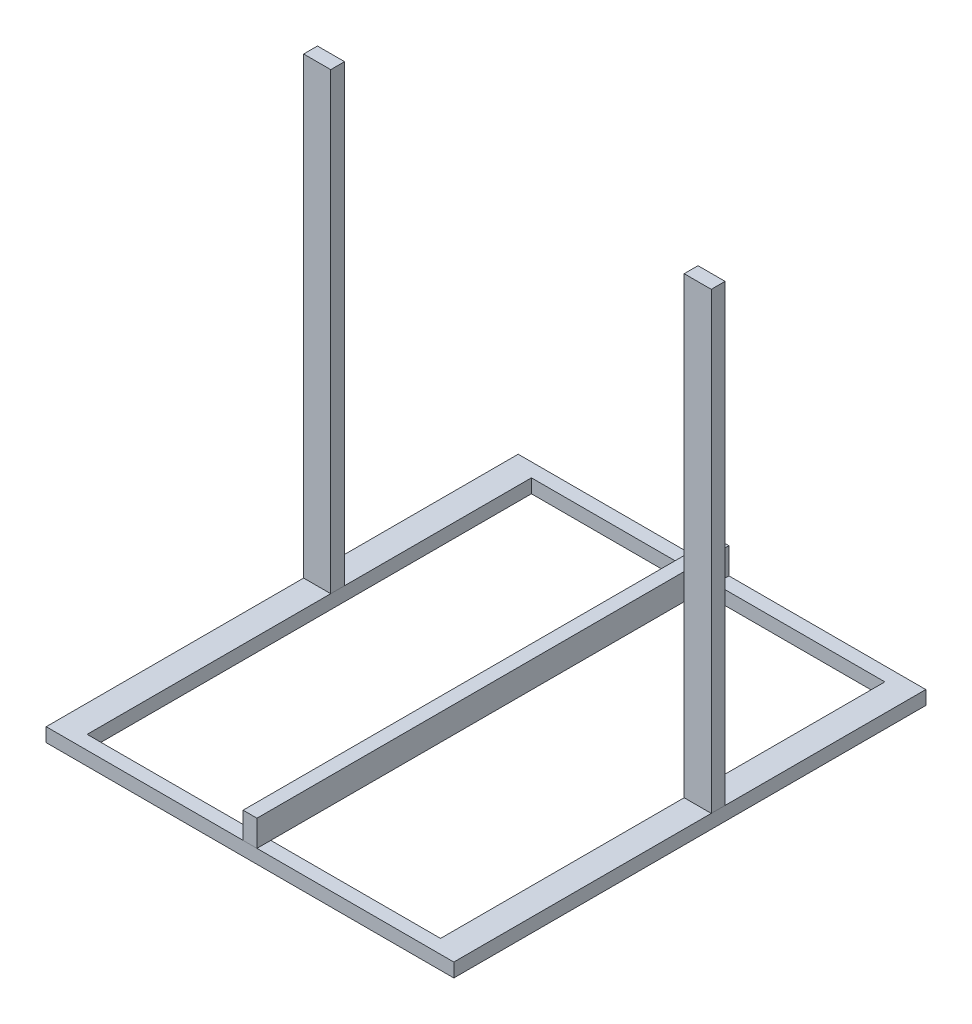
ISO-10303-21;
HEADER;
FILE_DESCRIPTION(('STEP AP214'),'2;1');
FILE_NAME('part.step','',(''),(''),'','','');
FILE_SCHEMA(('AUTOMOTIVE_DESIGN { 1 0 10303 214 1 1 1 1 }'));
ENDSEC;
DATA;
#1=APPLICATION_CONTEXT('core data for automotive mechanical design processes');
#2=APPLICATION_PROTOCOL_DEFINITION('international standard','automotive_design',2000,#1);
#3=PRODUCT_CONTEXT('',#1,'mechanical');
#4=PRODUCT('Part','Part','',(#3));
#5=PRODUCT_RELATED_PRODUCT_CATEGORY('part','',(#4));
#6=PRODUCT_DEFINITION_FORMATION('','',#4);
#7=PRODUCT_DEFINITION_CONTEXT('part definition',#1,'design');
#8=PRODUCT_DEFINITION('design','',#6,#7);
#9=PRODUCT_DEFINITION_SHAPE('','',#8);
#10=(LENGTH_UNIT() NAMED_UNIT(*) SI_UNIT(.MILLI.,.METRE.));
#11=(NAMED_UNIT(*) PLANE_ANGLE_UNIT() SI_UNIT($,.RADIAN.));
#12=(NAMED_UNIT(*) SI_UNIT($,.STERADIAN.) SOLID_ANGLE_UNIT());
#13=UNCERTAINTY_MEASURE_WITH_UNIT(LENGTH_MEASURE(1.E-05),#10,'distance_accuracy_value','');
#14=(GEOMETRIC_REPRESENTATION_CONTEXT(3) GLOBAL_UNCERTAINTY_ASSIGNED_CONTEXT((#13)) GLOBAL_UNIT_ASSIGNED_CONTEXT((#10,
#11,#12)) REPRESENTATION_CONTEXT('',''));
#15=CARTESIAN_POINT('',(0.,0.,0.));
#16=DIRECTION('',(0.,0.,1.));
#17=DIRECTION('',(1.,0.,0.));
#18=AXIS2_PLACEMENT_3D('',#15,#16,#17);
#19=CARTESIAN_POINT('',(-10.27,20.47,328.78));
#20=DIRECTION('',(0.,1.,0.));
#21=DIRECTION('',(0.,0.,1.));
#22=AXIS2_PLACEMENT_3D('',#19,#20,#21);
#23=PLANE('',#22);
#24=DIRECTION('',(-1.,0.,0.));
#25=VECTOR('',#24,1.);
#26=CARTESIAN_POINT('',(261.525,20.47,-328.78));
#27=LINE('',#26,#25);
#28=CARTESIAN_POINT('',(261.525,20.47,-328.78));
#29=VERTEX_POINT('',#28);
#30=CARTESIAN_POINT('',(-261.525,20.47,-328.78));
#31=VERTEX_POINT('',#30);
#32=EDGE_CURVE('E120',#29,#31,#27,.T.);
#33=ORIENTED_EDGE('',*,*,#32,.F.);
#34=DIRECTION('',(0.,0.,-1.));
#35=VECTOR('',#34,1.);
#36=CARTESIAN_POINT('',(261.525,20.47,-328.78));
#37=LINE('',#36,#35);
#38=CARTESIAN_POINT('',(261.525,20.47,328.78));
#39=VERTEX_POINT('',#38);
#40=EDGE_CURVE('E122',#39,#29,#37,.T.);
#41=ORIENTED_EDGE('',*,*,#40,.F.);
#42=DIRECTION('',(1.,0.,0.));
#43=VECTOR('',#42,1.);
#44=CARTESIAN_POINT('',(261.525,20.47,328.78));
#45=LINE('',#44,#43);
#46=CARTESIAN_POINT('',(-261.525,20.47,328.78));
#47=VERTEX_POINT('',#46);
#48=EDGE_CURVE('E12',#47,#39,#45,.T.);
#49=ORIENTED_EDGE('',*,*,#48,.F.);
#50=DIRECTION('',(0.,0.,1.));
#51=VECTOR('',#50,1.);
#52=CARTESIAN_POINT('',(-261.525,20.47,-328.78));
#53=LINE('',#52,#51);
#54=EDGE_CURVE('E124',#31,#47,#53,.T.);
#55=ORIENTED_EDGE('',*,*,#54,.F.);
#56=EDGE_LOOP('',(#33,#41,#49,#55));
#57=FACE_BOUND('',#56,.T.);
#58=DIRECTION('',(-1.,0.,0.));
#59=VECTOR('',#58,1.);
#60=CARTESIAN_POINT('',(-301.625,20.47,-349.25));
#61=LINE('',#60,#59);
#62=CARTESIAN_POINT('',(301.625,20.47,-349.25));
#63=VERTEX_POINT('',#62);
#64=CARTESIAN_POINT('',(-301.625,20.47,-349.25));
#65=VERTEX_POINT('',#64);
#66=EDGE_CURVE('E172',#63,#65,#61,.T.);
#67=ORIENTED_EDGE('',*,*,#66,.T.);
#68=DIRECTION('',(0.,0.,1.));
#69=VECTOR('',#68,1.);
#70=CARTESIAN_POINT('',(-301.625,20.47,349.25));
#71=LINE('',#70,#69);
#72=CARTESIAN_POINT('',(-301.625,20.47,349.25));
#73=VERTEX_POINT('',#72);
#74=EDGE_CURVE('E176',#65,#73,#71,.T.);
#75=ORIENTED_EDGE('',*,*,#74,.T.);
#76=DIRECTION('',(1.,0.,0.));
#77=VECTOR('',#76,1.);
#78=CARTESIAN_POINT('',(-301.625,20.47,349.25));
#79=LINE('',#78,#77);
#80=CARTESIAN_POINT('',(301.625,20.47,349.25));
#81=VERTEX_POINT('',#80);
#82=EDGE_CURVE('E180',#73,#81,#79,.T.);
#83=ORIENTED_EDGE('',*,*,#82,.T.);
#84=DIRECTION('',(0.,0.,-1.));
#85=VECTOR('',#84,1.);
#86=CARTESIAN_POINT('',(301.625,20.47,349.25));
#87=LINE('',#86,#85);
#88=EDGE_CURVE('E167',#81,#63,#87,.T.);
#89=ORIENTED_EDGE('',*,*,#88,.T.);
#90=EDGE_LOOP('',(#67,#75,#83,#89));
#91=FACE_BOUND('',#90,.T.);
#92=ADVANCED_FACE('F51',(#57,#91),#23,.T.);
#93=CARTESIAN_POINT('',(-301.625,20.47,-349.25));
#94=DIRECTION('',(0.,0.,1.));
#95=DIRECTION('',(1.,0.,0.));
#96=AXIS2_PLACEMENT_3D('',#93,#94,#95);
#97=PLANE('',#96);
#98=ORIENTED_EDGE('',*,*,#66,.F.);
#99=DIRECTION('',(0.,-1.,0.));
#100=VECTOR('',#99,1.);
#101=CARTESIAN_POINT('',(301.625,20.47,-349.25));
#102=LINE('',#101,#100);
#103=CARTESIAN_POINT('',(301.625,0.,-349.25));
#104=VERTEX_POINT('',#103);
#105=EDGE_CURVE('E203',#63,#104,#102,.T.);
#106=ORIENTED_EDGE('',*,*,#105,.T.);
#107=DIRECTION('',(-1.,0.,0.));
#108=VECTOR('',#107,1.);
#109=CARTESIAN_POINT('',(-301.625,0.,-349.25));
#110=LINE('',#109,#108);
#111=CARTESIAN_POINT('',(-301.625,0.,-349.25));
#112=VERTEX_POINT('',#111);
#113=EDGE_CURVE('E164',#104,#112,#110,.T.);
#114=ORIENTED_EDGE('',*,*,#113,.T.);
#115=DIRECTION('',(0.,-1.,0.));
#116=VECTOR('',#115,1.);
#117=CARTESIAN_POINT('',(-301.625,20.47,-349.25));
#118=LINE('',#117,#116);
#119=EDGE_CURVE('E199',#65,#112,#118,.T.);
#120=ORIENTED_EDGE('',*,*,#119,.F.);
#121=EDGE_LOOP('',(#98,#106,#114,#120));
#122=FACE_BOUND('',#121,.T.);
#123=ADVANCED_FACE('F208',(#122),#97,.F.);
#124=CARTESIAN_POINT('',(301.625,20.47,349.25));
#125=DIRECTION('',(-1.,0.,0.));
#126=DIRECTION('',(0.,0.,1.));
#127=AXIS2_PLACEMENT_3D('',#124,#125,#126);
#128=PLANE('',#127);
#129=ORIENTED_EDGE('',*,*,#88,.F.);
#130=DIRECTION('',(0.,-1.,0.));
#131=VECTOR('',#130,1.);
#132=CARTESIAN_POINT('',(301.625,20.47,349.25));
#133=LINE('',#132,#131);
#134=CARTESIAN_POINT('',(301.625,0.,349.25));
#135=VERTEX_POINT('',#134);
#136=EDGE_CURVE('E183',#81,#135,#133,.T.);
#137=ORIENTED_EDGE('',*,*,#136,.T.);
#138=DIRECTION('',(0.,0.,-1.));
#139=VECTOR('',#138,1.);
#140=CARTESIAN_POINT('',(301.625,0.,349.25));
#141=LINE('',#140,#139);
#142=EDGE_CURVE('E161',#135,#104,#141,.T.);
#143=ORIENTED_EDGE('',*,*,#142,.T.);
#144=ORIENTED_EDGE('',*,*,#105,.F.);
#145=EDGE_LOOP('',(#129,#137,#143,#144));
#146=FACE_BOUND('',#145,.T.);
#147=ADVANCED_FACE('F212',(#146),#128,.F.);
#148=CARTESIAN_POINT('',(-261.525,20.47,-328.78));
#149=DIRECTION('',(1.,0.,0.));
#150=DIRECTION('',(0.,0.,-1.));
#151=AXIS2_PLACEMENT_3D('',#148,#149,#150);
#152=PLANE('',#151);
#153=DIRECTION('',(0.,-1.,0.));
#154=VECTOR('',#153,1.);
#155=CARTESIAN_POINT('',(-261.525,20.47,-328.78));
#156=LINE('',#155,#154);
#157=CARTESIAN_POINT('',(-261.525,0.,-328.78));
#158=VERTEX_POINT('',#157);
#159=EDGE_CURVE('E129',#31,#158,#156,.T.);
#160=ORIENTED_EDGE('',*,*,#159,.F.);
#161=ORIENTED_EDGE('',*,*,#54,.T.);
#162=DIRECTION('',(0.,-1.,0.));
#163=VECTOR('',#162,1.);
#164=CARTESIAN_POINT('',(-261.525,20.47,328.78));
#165=LINE('',#164,#163);
#166=CARTESIAN_POINT('',(-261.525,0.,328.78));
#167=VERTEX_POINT('',#166);
#168=EDGE_CURVE('E142',#47,#167,#165,.T.);
#169=ORIENTED_EDGE('',*,*,#168,.T.);
#170=DIRECTION('',(0.,0.,1.));
#171=VECTOR('',#170,1.);
#172=CARTESIAN_POINT('',(-261.525,0.,-328.78));
#173=LINE('',#172,#171);
#174=EDGE_CURVE('E61',#158,#167,#173,.T.);
#175=ORIENTED_EDGE('',*,*,#174,.F.);
#176=EDGE_LOOP('',(#160,#161,#169,#175));
#177=FACE_BOUND('',#176,.T.);
#178=ADVANCED_FACE('F158',(#177),#152,.T.);
#179=CARTESIAN_POINT('',(261.525,20.47,-328.78));
#180=DIRECTION('',(-1.,0.,0.));
#181=DIRECTION('',(0.,0.,1.));
#182=AXIS2_PLACEMENT_3D('',#179,#180,#181);
#183=PLANE('',#182);
#184=DIRECTION('',(0.,-1.,0.));
#185=VECTOR('',#184,1.);
#186=CARTESIAN_POINT('',(261.525,20.47,328.78));
#187=LINE('',#186,#185);
#188=CARTESIAN_POINT('',(261.525,0.,328.78));
#189=VERTEX_POINT('',#188);
#190=EDGE_CURVE('E130',#39,#189,#187,.T.);
#191=ORIENTED_EDGE('',*,*,#190,.F.);
#192=ORIENTED_EDGE('',*,*,#40,.T.);
#193=DIRECTION('',(0.,-1.,0.));
#194=VECTOR('',#193,1.);
#195=CARTESIAN_POINT('',(261.525,20.47,-328.78));
#196=LINE('',#195,#194);
#197=CARTESIAN_POINT('',(261.525,0.,-328.78));
#198=VERTEX_POINT('',#197);
#199=EDGE_CURVE('E88',#29,#198,#196,.T.);
#200=ORIENTED_EDGE('',*,*,#199,.T.);
#201=DIRECTION('',(0.,0.,-1.));
#202=VECTOR('',#201,1.);
#203=CARTESIAN_POINT('',(261.525,0.,-328.78));
#204=LINE('',#203,#202);
#205=EDGE_CURVE('E148',#189,#198,#204,.T.);
#206=ORIENTED_EDGE('',*,*,#205,.F.);
#207=EDGE_LOOP('',(#191,#192,#200,#206));
#208=FACE_BOUND('',#207,.T.);
#209=ADVANCED_FACE('F53',(#208),#183,.T.);
#210=CARTESIAN_POINT('',(0.,0.,0.));
#211=DIRECTION('',(0.,-1.,0.));
#212=DIRECTION('',(0.,0.,-1.));
#213=AXIS2_PLACEMENT_3D('',#210,#211,#212);
#214=PLANE('',#213);
#215=ORIENTED_EDGE('',*,*,#142,.F.);
#216=DIRECTION('',(1.,0.,0.));
#217=VECTOR('',#216,1.);
#218=CARTESIAN_POINT('',(-301.625,0.,349.25));
#219=LINE('',#218,#217);
#220=CARTESIAN_POINT('',(-301.625,0.,349.25));
#221=VERTEX_POINT('',#220);
#222=EDGE_CURVE('E171',#221,#135,#219,.T.);
#223=ORIENTED_EDGE('',*,*,#222,.F.);
#224=DIRECTION('',(0.,0.,1.));
#225=VECTOR('',#224,1.);
#226=CARTESIAN_POINT('',(-301.625,0.,349.25));
#227=LINE('',#226,#225);
#228=EDGE_CURVE('E187',#112,#221,#227,.T.);
#229=ORIENTED_EDGE('',*,*,#228,.F.);
#230=ORIENTED_EDGE('',*,*,#113,.F.);
#231=EDGE_LOOP('',(#215,#223,#229,#230));
#232=FACE_BOUND('',#231,.T.);
#233=DIRECTION('',(-1.,0.,0.));
#234=VECTOR('',#233,1.);
#235=CARTESIAN_POINT('',(261.525,0.,-328.78));
#236=LINE('',#235,#234);
#237=EDGE_CURVE('E135',#198,#158,#236,.T.);
#238=ORIENTED_EDGE('',*,*,#237,.T.);
#239=ORIENTED_EDGE('',*,*,#174,.T.);
#240=DIRECTION('',(1.,0.,0.));
#241=VECTOR('',#240,1.);
#242=CARTESIAN_POINT('',(261.525,0.,328.78));
#243=LINE('',#242,#241);
#244=EDGE_CURVE('E69',#167,#189,#243,.T.);
#245=ORIENTED_EDGE('',*,*,#244,.T.);
#246=ORIENTED_EDGE('',*,*,#205,.T.);
#247=EDGE_LOOP('',(#238,#239,#245,#246));
#248=FACE_BOUND('',#247,.T.);
#249=ADVANCED_FACE('F216',(#232,#248),#214,.T.);
#250=CARTESIAN_POINT('',(261.525,20.47,-328.78));
#251=DIRECTION('',(0.,0.,1.));
#252=DIRECTION('',(1.,0.,0.));
#253=AXIS2_PLACEMENT_3D('',#250,#251,#252);
#254=PLANE('',#253);
#255=ORIENTED_EDGE('',*,*,#237,.F.);
#256=ORIENTED_EDGE('',*,*,#199,.F.);
#257=ORIENTED_EDGE('',*,*,#32,.T.);
#258=ORIENTED_EDGE('',*,*,#159,.T.);
#259=EDGE_LOOP('',(#255,#256,#257,#258));
#260=FACE_BOUND('',#259,.T.);
#261=ADVANCED_FACE('F133',(#260),#254,.T.);
#262=CARTESIAN_POINT('',(261.525,20.47,328.78));
#263=DIRECTION('',(0.,0.,-1.));
#264=DIRECTION('',(-1.,0.,0.));
#265=AXIS2_PLACEMENT_3D('',#262,#263,#264);
#266=PLANE('',#265);
#267=ORIENTED_EDGE('',*,*,#244,.F.);
#268=ORIENTED_EDGE('',*,*,#168,.F.);
#269=ORIENTED_EDGE('',*,*,#48,.T.);
#270=ORIENTED_EDGE('',*,*,#190,.T.);
#271=EDGE_LOOP('',(#267,#268,#269,#270));
#272=FACE_BOUND('',#271,.T.);
#273=ADVANCED_FACE('F159',(#272),#266,.T.);
#274=CARTESIAN_POINT('',(-301.625,20.47,349.25));
#275=DIRECTION('',(1.,0.,0.));
#276=DIRECTION('',(0.,0.,-1.));
#277=AXIS2_PLACEMENT_3D('',#274,#275,#276);
#278=PLANE('',#277);
#279=ORIENTED_EDGE('',*,*,#74,.F.);
#280=ORIENTED_EDGE('',*,*,#119,.T.);
#281=ORIENTED_EDGE('',*,*,#228,.T.);
#282=DIRECTION('',(0.,-1.,0.));
#283=VECTOR('',#282,1.);
#284=CARTESIAN_POINT('',(-301.625,20.47,349.25));
#285=LINE('',#284,#283);
#286=EDGE_CURVE('E195',#73,#221,#285,.T.);
#287=ORIENTED_EDGE('',*,*,#286,.F.);
#288=EDGE_LOOP('',(#279,#280,#281,#287));
#289=FACE_BOUND('',#288,.T.);
#290=ADVANCED_FACE('F221',(#289),#278,.F.);
#291=CARTESIAN_POINT('',(-301.625,20.47,349.25));
#292=DIRECTION('',(0.,0.,-1.));
#293=DIRECTION('',(-1.,0.,0.));
#294=AXIS2_PLACEMENT_3D('',#291,#292,#293);
#295=PLANE('',#294);
#296=ORIENTED_EDGE('',*,*,#82,.F.);
#297=ORIENTED_EDGE('',*,*,#286,.T.);
#298=ORIENTED_EDGE('',*,*,#222,.T.);
#299=ORIENTED_EDGE('',*,*,#136,.F.);
#300=EDGE_LOOP('',(#296,#297,#298,#299));
#301=FACE_BOUND('',#300,.T.);
#302=ADVANCED_FACE('F223',(#301),#295,.F.);
#303=CLOSED_SHELL('',(#92,#123,#147,#178,#209,#249,#261,#273,#290,#302));
#304=MANIFOLD_SOLID_BREP('B2',#303);
#305=CARTESIAN_POINT('',(-10.27,20.47,328.78));
#306=DIRECTION('',(0.,1.,0.));
#307=DIRECTION('',(0.,0.,1.));
#308=AXIS2_PLACEMENT_3D('',#305,#306,#307);
#309=PLANE('',#308);
#310=DIRECTION('',(1.,0.,0.));
#311=VECTOR('',#310,1.);
#312=CARTESIAN_POINT('',(301.625,20.47,-31.7500000000001));
#313=LINE('',#312,#311);
#314=CARTESIAN_POINT('',(261.525,20.47,-31.7500000000001));
#315=VERTEX_POINT('',#314);
#316=CARTESIAN_POINT('',(301.625,20.47,-31.7500000000001));
#317=VERTEX_POINT('',#316);
#318=EDGE_CURVE('E49',#315,#317,#313,.T.);
#319=ORIENTED_EDGE('',*,*,#318,.F.);
#320=DIRECTION('',(0.,0.,-1.));
#321=VECTOR('',#320,1.);
#322=CARTESIAN_POINT('',(261.525,20.47,-328.78));
#323=LINE('',#322,#321);
#324=CARTESIAN_POINT('',(261.525,20.47,-52.2200000000001));
#325=VERTEX_POINT('',#324);
#326=EDGE_CURVE('E347',#315,#325,#323,.T.);
#327=ORIENTED_EDGE('',*,*,#326,.T.);
#328=DIRECTION('',(-1.,0.,0.));
#329=VECTOR('',#328,1.);
#330=CARTESIAN_POINT('',(301.625,20.47,-52.22));
#331=LINE('',#330,#329);
#332=CARTESIAN_POINT('',(301.625,20.47,-52.22));
#333=VERTEX_POINT('',#332);
#334=EDGE_CURVE('E353',#333,#325,#331,.T.);
#335=ORIENTED_EDGE('',*,*,#334,.F.);
#336=DIRECTION('',(0.,0.,-1.));
#337=VECTOR('',#336,1.);
#338=CARTESIAN_POINT('',(301.625,20.47,349.25));
#339=LINE('',#338,#337);
#340=EDGE_CURVE('E387',#317,#333,#339,.T.);
#341=ORIENTED_EDGE('',*,*,#340,.F.);
#342=EDGE_LOOP('',(#319,#327,#335,#341));
#343=FACE_BOUND('',#342,.T.);
#344=ADVANCED_FACE('F344',(#343),#309,.F.);
#345=CARTESIAN_POINT('',(301.625,20.47,349.25));
#346=DIRECTION('',(-1.,0.,0.));
#347=DIRECTION('',(0.,0.,1.));
#348=AXIS2_PLACEMENT_3D('',#345,#346,#347);
#349=PLANE('',#348);
#350=DIRECTION('',(0.,-1.,0.));
#351=VECTOR('',#350,1.);
#352=CARTESIAN_POINT('',(301.625,692.15,-31.7500000000001));
#353=LINE('',#352,#351);
#354=CARTESIAN_POINT('',(301.625,692.15,-31.7500000000001));
#355=VERTEX_POINT('',#354);
#356=EDGE_CURVE('E407',#355,#317,#353,.T.);
#357=ORIENTED_EDGE('',*,*,#356,.T.);
#358=ORIENTED_EDGE('',*,*,#340,.T.);
#359=DIRECTION('',(0.,-1.,0.));
#360=VECTOR('',#359,1.);
#361=CARTESIAN_POINT('',(301.625,692.15,-52.22));
#362=LINE('',#361,#360);
#363=CARTESIAN_POINT('',(301.625,692.15,-52.22));
#364=VERTEX_POINT('',#363);
#365=EDGE_CURVE('E398',#364,#333,#362,.T.);
#366=ORIENTED_EDGE('',*,*,#365,.F.);
#367=DIRECTION('',(0.,0.,-1.));
#368=VECTOR('',#367,1.);
#369=CARTESIAN_POINT('',(301.625,692.15,-52.22));
#370=LINE('',#369,#368);
#371=EDGE_CURVE('E405',#355,#364,#370,.T.);
#372=ORIENTED_EDGE('',*,*,#371,.F.);
#373=EDGE_LOOP('',(#357,#358,#366,#372));
#374=FACE_BOUND('',#373,.T.);
#375=ADVANCED_FACE('F417',(#374),#349,.F.);
#376=CARTESIAN_POINT('',(0.,692.15,0.));
#377=DIRECTION('',(0.,-1.,0.));
#378=DIRECTION('',(0.,0.,-1.));
#379=AXIS2_PLACEMENT_3D('',#376,#377,#378);
#380=PLANE('',#379);
#381=DIRECTION('',(0.,0.,1.));
#382=VECTOR('',#381,1.);
#383=CARTESIAN_POINT('',(261.525,692.15,-52.2200000000001));
#384=LINE('',#383,#382);
#385=CARTESIAN_POINT('',(261.525,692.15,-52.2200000000001));
#386=VERTEX_POINT('',#385);
#387=CARTESIAN_POINT('',(261.525,692.15,-31.7500000000001));
#388=VERTEX_POINT('',#387);
#389=EDGE_CURVE('E400',#386,#388,#384,.T.);
#390=ORIENTED_EDGE('',*,*,#389,.T.);
#391=DIRECTION('',(1.,0.,0.));
#392=VECTOR('',#391,1.);
#393=CARTESIAN_POINT('',(301.625,692.15,-31.7500000000001));
#394=LINE('',#393,#392);
#395=EDGE_CURVE('E379',#388,#355,#394,.T.);
#396=ORIENTED_EDGE('',*,*,#395,.T.);
#397=ORIENTED_EDGE('',*,*,#371,.T.);
#398=DIRECTION('',(-1.,0.,0.));
#399=VECTOR('',#398,1.);
#400=CARTESIAN_POINT('',(301.625,692.15,-52.22));
#401=LINE('',#400,#399);
#402=EDGE_CURVE('E403',#364,#386,#401,.T.);
#403=ORIENTED_EDGE('',*,*,#402,.T.);
#404=EDGE_LOOP('',(#390,#396,#397,#403));
#405=FACE_BOUND('',#404,.T.);
#406=ADVANCED_FACE('F412',(#405),#380,.F.);
#407=CARTESIAN_POINT('',(261.525,20.47,-328.78));
#408=DIRECTION('',(-1.,0.,0.));
#409=DIRECTION('',(0.,0.,1.));
#410=AXIS2_PLACEMENT_3D('',#407,#408,#409);
#411=PLANE('',#410);
#412=ORIENTED_EDGE('',*,*,#326,.F.);
#413=DIRECTION('',(0.,-1.,0.));
#414=VECTOR('',#413,1.);
#415=CARTESIAN_POINT('',(261.525,692.15,-31.7500000000001));
#416=LINE('',#415,#414);
#417=EDGE_CURVE('E413',#388,#315,#416,.T.);
#418=ORIENTED_EDGE('',*,*,#417,.F.);
#419=ORIENTED_EDGE('',*,*,#389,.F.);
#420=DIRECTION('',(0.,-1.,0.));
#421=VECTOR('',#420,1.);
#422=CARTESIAN_POINT('',(261.525,692.15,-52.2200000000001));
#423=LINE('',#422,#421);
#424=EDGE_CURVE('E396',#386,#325,#423,.T.);
#425=ORIENTED_EDGE('',*,*,#424,.T.);
#426=EDGE_LOOP('',(#412,#418,#419,#425));
#427=FACE_BOUND('',#426,.T.);
#428=ADVANCED_FACE('F402',(#427),#411,.T.);
#429=CARTESIAN_POINT('',(301.625,692.15,-52.22));
#430=DIRECTION('',(0.,0.,1.));
#431=DIRECTION('',(1.,0.,0.));
#432=AXIS2_PLACEMENT_3D('',#429,#430,#431);
#433=PLANE('',#432);
#434=ORIENTED_EDGE('',*,*,#334,.T.);
#435=ORIENTED_EDGE('',*,*,#424,.F.);
#436=ORIENTED_EDGE('',*,*,#402,.F.);
#437=ORIENTED_EDGE('',*,*,#365,.T.);
#438=EDGE_LOOP('',(#434,#435,#436,#437));
#439=FACE_BOUND('',#438,.T.);
#440=ADVANCED_FACE('F394',(#439),#433,.F.);
#441=CARTESIAN_POINT('',(301.625,692.15,-31.7500000000001));
#442=DIRECTION('',(0.,0.,-1.));
#443=DIRECTION('',(-1.,0.,0.));
#444=AXIS2_PLACEMENT_3D('',#441,#442,#443);
#445=PLANE('',#444);
#446=ORIENTED_EDGE('',*,*,#318,.T.);
#447=ORIENTED_EDGE('',*,*,#356,.F.);
#448=ORIENTED_EDGE('',*,*,#395,.F.);
#449=ORIENTED_EDGE('',*,*,#417,.T.);
#450=EDGE_LOOP('',(#446,#447,#448,#449));
#451=FACE_BOUND('',#450,.T.);
#452=ADVANCED_FACE('F418',(#451),#445,.F.);
#453=CLOSED_SHELL('',(#344,#375,#406,#428,#440,#452));
#454=MANIFOLD_SOLID_BREP('B6',#453);
#455=CARTESIAN_POINT('',(-10.27,20.47,328.78));
#456=DIRECTION('',(0.,1.,0.));
#457=DIRECTION('',(0.,0.,1.));
#458=AXIS2_PLACEMENT_3D('',#455,#456,#457);
#459=PLANE('',#458);
#460=DIRECTION('',(1.,0.,0.));
#461=VECTOR('',#460,1.);
#462=CARTESIAN_POINT('',(-301.625,20.47,349.25));
#463=LINE('',#462,#461);
#464=CARTESIAN_POINT('',(-10.27,20.47,349.25));
#465=VERTEX_POINT('',#464);
#466=CARTESIAN_POINT('',(10.27,20.47,349.25));
#467=VERTEX_POINT('',#466);
#468=EDGE_CURVE('E534',#465,#467,#463,.T.);
#469=ORIENTED_EDGE('',*,*,#468,.F.);
#470=DIRECTION('',(0.,0.,1.));
#471=VECTOR('',#470,1.);
#472=CARTESIAN_POINT('',(-10.27,20.47,-349.25));
#473=LINE('',#472,#471);
#474=CARTESIAN_POINT('',(-10.27,20.47,-349.25));
#475=VERTEX_POINT('',#474);
#476=EDGE_CURVE('E491',#475,#465,#473,.T.);
#477=ORIENTED_EDGE('',*,*,#476,.F.);
#478=DIRECTION('',(-1.,0.,0.));
#479=VECTOR('',#478,1.);
#480=CARTESIAN_POINT('',(-301.625,20.47,-349.25));
#481=LINE('',#480,#479);
#482=CARTESIAN_POINT('',(10.27,20.47,-349.25));
#483=VERTEX_POINT('',#482);
#484=EDGE_CURVE('E500',#483,#475,#481,.T.);
#485=ORIENTED_EDGE('',*,*,#484,.F.);
#486=DIRECTION('',(0.,0.,-1.));
#487=VECTOR('',#486,1.);
#488=CARTESIAN_POINT('',(10.27,20.47,-349.25));
#489=LINE('',#488,#487);
#490=EDGE_CURVE('E342',#467,#483,#489,.T.);
#491=ORIENTED_EDGE('',*,*,#490,.F.);
#492=EDGE_LOOP('',(#469,#477,#485,#491));
#493=FACE_BOUND('',#492,.T.);
#494=ADVANCED_FACE('F482',(#493),#459,.F.);
#495=CARTESIAN_POINT('',(-301.625,20.47,349.25));
#496=DIRECTION('',(0.,0.,-1.));
#497=DIRECTION('',(-1.,0.,0.));
#498=AXIS2_PLACEMENT_3D('',#495,#496,#497);
#499=PLANE('',#498);
#500=DIRECTION('',(0.,-1.,0.));
#501=VECTOR('',#500,1.);
#502=CARTESIAN_POINT('',(-10.27,59.14,349.25));
#503=LINE('',#502,#501);
#504=CARTESIAN_POINT('',(-10.27,59.14,349.25));
#505=VERTEX_POINT('',#504);
#506=EDGE_CURVE('E530',#505,#465,#503,.T.);
#507=ORIENTED_EDGE('',*,*,#506,.T.);
#508=ORIENTED_EDGE('',*,*,#468,.T.);
#509=DIRECTION('',(0.,-1.,0.));
#510=VECTOR('',#509,1.);
#511=CARTESIAN_POINT('',(10.27,59.14,349.25));
#512=LINE('',#511,#510);
#513=CARTESIAN_POINT('',(10.27,59.14,349.25));
#514=VERTEX_POINT('',#513);
#515=EDGE_CURVE('E542',#514,#467,#512,.T.);
#516=ORIENTED_EDGE('',*,*,#515,.F.);
#517=DIRECTION('',(1.,0.,0.));
#518=VECTOR('',#517,1.);
#519=CARTESIAN_POINT('',(-10.27,59.14,349.25));
#520=LINE('',#519,#518);
#521=EDGE_CURVE('E541',#505,#514,#520,.T.);
#522=ORIENTED_EDGE('',*,*,#521,.F.);
#523=EDGE_LOOP('',(#507,#508,#516,#522));
#524=FACE_BOUND('',#523,.T.);
#525=ADVANCED_FACE('F540',(#524),#499,.F.);
#526=CARTESIAN_POINT('',(0.,59.14,0.));
#527=DIRECTION('',(0.,1.,0.));
#528=DIRECTION('',(0.,0.,1.));
#529=AXIS2_PLACEMENT_3D('',#526,#527,#528);
#530=PLANE('',#529);
#531=DIRECTION('',(0.,0.,-1.));
#532=VECTOR('',#531,1.);
#533=CARTESIAN_POINT('',(10.27,59.14,-349.25));
#534=LINE('',#533,#532);
#535=CARTESIAN_POINT('',(10.27,59.14,-349.25));
#536=VERTEX_POINT('',#535);
#537=EDGE_CURVE('E485',#514,#536,#534,.T.);
#538=ORIENTED_EDGE('',*,*,#537,.T.);
#539=DIRECTION('',(-1.,0.,0.));
#540=VECTOR('',#539,1.);
#541=CARTESIAN_POINT('',(-10.27,59.14,-349.25));
#542=LINE('',#541,#540);
#543=CARTESIAN_POINT('',(-10.27,59.14,-349.25));
#544=VERTEX_POINT('',#543);
#545=EDGE_CURVE('E515',#536,#544,#542,.T.);
#546=ORIENTED_EDGE('',*,*,#545,.T.);
#547=DIRECTION('',(0.,0.,1.));
#548=VECTOR('',#547,1.);
#549=CARTESIAN_POINT('',(-10.27,59.14,-349.25));
#550=LINE('',#549,#548);
#551=EDGE_CURVE('E549',#544,#505,#550,.T.);
#552=ORIENTED_EDGE('',*,*,#551,.T.);
#553=ORIENTED_EDGE('',*,*,#521,.T.);
#554=EDGE_LOOP('',(#538,#546,#552,#553));
#555=FACE_BOUND('',#554,.T.);
#556=ADVANCED_FACE('F552',(#555),#530,.T.);
#557=CARTESIAN_POINT('',(-301.625,20.47,-349.25));
#558=DIRECTION('',(0.,0.,1.));
#559=DIRECTION('',(1.,0.,0.));
#560=AXIS2_PLACEMENT_3D('',#557,#558,#559);
#561=PLANE('',#560);
#562=DIRECTION('',(0.,-1.,0.));
#563=VECTOR('',#562,1.);
#564=CARTESIAN_POINT('',(10.27,59.14,-349.25));
#565=LINE('',#564,#563);
#566=EDGE_CURVE('E538',#536,#483,#565,.T.);
#567=ORIENTED_EDGE('',*,*,#566,.T.);
#568=ORIENTED_EDGE('',*,*,#484,.T.);
#569=DIRECTION('',(0.,-1.,0.));
#570=VECTOR('',#569,1.);
#571=CARTESIAN_POINT('',(-10.27,59.14,-349.25));
#572=LINE('',#571,#570);
#573=EDGE_CURVE('E532',#544,#475,#572,.T.);
#574=ORIENTED_EDGE('',*,*,#573,.F.);
#575=ORIENTED_EDGE('',*,*,#545,.F.);
#576=EDGE_LOOP('',(#567,#568,#574,#575));
#577=FACE_BOUND('',#576,.T.);
#578=ADVANCED_FACE('F556',(#577),#561,.F.);
#579=CARTESIAN_POINT('',(10.27,59.14,-349.25));
#580=DIRECTION('',(-1.,0.,0.));
#581=DIRECTION('',(0.,0.,1.));
#582=AXIS2_PLACEMENT_3D('',#579,#580,#581);
#583=PLANE('',#582);
#584=ORIENTED_EDGE('',*,*,#515,.T.);
#585=ORIENTED_EDGE('',*,*,#490,.T.);
#586=ORIENTED_EDGE('',*,*,#566,.F.);
#587=ORIENTED_EDGE('',*,*,#537,.F.);
#588=EDGE_LOOP('',(#584,#585,#586,#587));
#589=FACE_BOUND('',#588,.T.);
#590=ADVANCED_FACE('F554',(#589),#583,.F.);
#591=CARTESIAN_POINT('',(-10.27,59.14,-349.25));
#592=DIRECTION('',(1.,0.,0.));
#593=DIRECTION('',(0.,0.,-1.));
#594=AXIS2_PLACEMENT_3D('',#591,#592,#593);
#595=PLANE('',#594);
#596=ORIENTED_EDGE('',*,*,#573,.T.);
#597=ORIENTED_EDGE('',*,*,#476,.T.);
#598=ORIENTED_EDGE('',*,*,#506,.F.);
#599=ORIENTED_EDGE('',*,*,#551,.F.);
#600=EDGE_LOOP('',(#596,#597,#598,#599));
#601=FACE_BOUND('',#600,.T.);
#602=ADVANCED_FACE('F527',(#601),#595,.F.);
#603=CLOSED_SHELL('',(#494,#525,#556,#578,#590,#602));
#604=MANIFOLD_SOLID_BREP('B43',#603);
#605=CARTESIAN_POINT('',(-10.27,20.47,328.78));
#606=DIRECTION('',(0.,1.,0.));
#607=DIRECTION('',(0.,0.,1.));
#608=AXIS2_PLACEMENT_3D('',#605,#606,#607);
#609=PLANE('',#608);
#610=DIRECTION('',(0.,0.,1.));
#611=VECTOR('',#610,1.);
#612=CARTESIAN_POINT('',(-261.525,20.47,-328.78));
#613=LINE('',#612,#611);
#614=CARTESIAN_POINT('',(-261.525,20.47,-52.22));
#615=VERTEX_POINT('',#614);
#616=CARTESIAN_POINT('',(-261.525,20.47,-31.75));
#617=VERTEX_POINT('',#616);
#618=EDGE_CURVE('E480',#615,#617,#613,.T.);
#619=ORIENTED_EDGE('',*,*,#618,.T.);
#620=DIRECTION('',(1.,0.,0.));
#621=VECTOR('',#620,1.);
#622=CARTESIAN_POINT('',(-261.525,20.47,-31.75));
#623=LINE('',#622,#621);
#624=CARTESIAN_POINT('',(-301.625,20.47,-31.75));
#625=VERTEX_POINT('',#624);
#626=EDGE_CURVE('E684',#625,#617,#623,.T.);
#627=ORIENTED_EDGE('',*,*,#626,.F.);
#628=DIRECTION('',(0.,0.,1.));
#629=VECTOR('',#628,1.);
#630=CARTESIAN_POINT('',(-301.625,20.47,349.25));
#631=LINE('',#630,#629);
#632=CARTESIAN_POINT('',(-301.625,20.47,-52.22));
#633=VERTEX_POINT('',#632);
#634=EDGE_CURVE('E624',#633,#625,#631,.T.);
#635=ORIENTED_EDGE('',*,*,#634,.F.);
#636=DIRECTION('',(-1.,0.,0.));
#637=VECTOR('',#636,1.);
#638=CARTESIAN_POINT('',(-261.525,20.47,-52.22));
#639=LINE('',#638,#637);
#640=EDGE_CURVE('E630',#615,#633,#639,.T.);
#641=ORIENTED_EDGE('',*,*,#640,.F.);
#642=EDGE_LOOP('',(#619,#627,#635,#641));
#643=FACE_BOUND('',#642,.T.);
#644=ADVANCED_FACE('F617',(#643),#609,.F.);
#645=CARTESIAN_POINT('',(-301.625,20.47,349.25));
#646=DIRECTION('',(1.,0.,0.));
#647=DIRECTION('',(0.,0.,-1.));
#648=AXIS2_PLACEMENT_3D('',#645,#646,#647);
#649=PLANE('',#648);
#650=DIRECTION('',(0.,-1.,0.));
#651=VECTOR('',#650,1.);
#652=CARTESIAN_POINT('',(-301.625,692.15,-52.22));
#653=LINE('',#652,#651);
#654=CARTESIAN_POINT('',(-301.625,692.15,-52.22));
#655=VERTEX_POINT('',#654);
#656=EDGE_CURVE('E681',#655,#633,#653,.T.);
#657=ORIENTED_EDGE('',*,*,#656,.T.);
#658=ORIENTED_EDGE('',*,*,#634,.T.);
#659=DIRECTION('',(0.,-1.,0.));
#660=VECTOR('',#659,1.);
#661=CARTESIAN_POINT('',(-301.625,692.15,-31.75));
#662=LINE('',#661,#660);
#663=CARTESIAN_POINT('',(-301.625,692.15,-31.75));
#664=VERTEX_POINT('',#663);
#665=EDGE_CURVE('E660',#664,#625,#662,.T.);
#666=ORIENTED_EDGE('',*,*,#665,.F.);
#667=DIRECTION('',(0.,0.,1.));
#668=VECTOR('',#667,1.);
#669=CARTESIAN_POINT('',(-301.625,692.15,-52.22));
#670=LINE('',#669,#668);
#671=EDGE_CURVE('E666',#655,#664,#670,.T.);
#672=ORIENTED_EDGE('',*,*,#671,.F.);
#673=EDGE_LOOP('',(#657,#658,#666,#672));
#674=FACE_BOUND('',#673,.T.);
#675=ADVANCED_FACE('F674',(#674),#649,.F.);
#676=CARTESIAN_POINT('',(-261.525,20.47,-328.78));
#677=DIRECTION('',(1.,0.,0.));
#678=DIRECTION('',(0.,0.,-1.));
#679=AXIS2_PLACEMENT_3D('',#676,#677,#678);
#680=PLANE('',#679);
#681=ORIENTED_EDGE('',*,*,#618,.F.);
#682=DIRECTION('',(0.,-1.,0.));
#683=VECTOR('',#682,1.);
#684=CARTESIAN_POINT('',(-261.525,692.15,-52.22));
#685=LINE('',#684,#683);
#686=CARTESIAN_POINT('',(-261.525,692.15,-52.22));
#687=VERTEX_POINT('',#686);
#688=EDGE_CURVE('E676',#687,#615,#685,.T.);
#689=ORIENTED_EDGE('',*,*,#688,.F.);
#690=DIRECTION('',(0.,0.,-1.));
#691=VECTOR('',#690,1.);
#692=CARTESIAN_POINT('',(-261.525,692.15,-52.22));
#693=LINE('',#692,#691);
#694=CARTESIAN_POINT('',(-261.525,692.15,-31.75));
#695=VERTEX_POINT('',#694);
#696=EDGE_CURVE('E665',#695,#687,#693,.T.);
#697=ORIENTED_EDGE('',*,*,#696,.F.);
#698=DIRECTION('',(0.,-1.,0.));
#699=VECTOR('',#698,1.);
#700=CARTESIAN_POINT('',(-261.525,692.15,-31.75));
#701=LINE('',#700,#699);
#702=EDGE_CURVE('E662',#695,#617,#701,.T.);
#703=ORIENTED_EDGE('',*,*,#702,.T.);
#704=EDGE_LOOP('',(#681,#689,#697,#703));
#705=FACE_BOUND('',#704,.T.);
#706=ADVANCED_FACE('F689',(#705),#680,.T.);
#707=CARTESIAN_POINT('',(-261.525,692.15,-31.75));
#708=DIRECTION('',(0.,0.,-1.));
#709=DIRECTION('',(-1.,0.,0.));
#710=AXIS2_PLACEMENT_3D('',#707,#708,#709);
#711=PLANE('',#710);
#712=ORIENTED_EDGE('',*,*,#626,.T.);
#713=ORIENTED_EDGE('',*,*,#702,.F.);
#714=DIRECTION('',(1.,0.,0.));
#715=VECTOR('',#714,1.);
#716=CARTESIAN_POINT('',(-261.525,692.15,-31.75));
#717=LINE('',#716,#715);
#718=EDGE_CURVE('E657',#664,#695,#717,.T.);
#719=ORIENTED_EDGE('',*,*,#718,.F.);
#720=ORIENTED_EDGE('',*,*,#665,.T.);
#721=EDGE_LOOP('',(#712,#713,#719,#720));
#722=FACE_BOUND('',#721,.T.);
#723=ADVANCED_FACE('F659',(#722),#711,.F.);
#724=CARTESIAN_POINT('',(-261.525,692.15,-52.22));
#725=DIRECTION('',(0.,0.,1.));
#726=DIRECTION('',(1.,0.,0.));
#727=AXIS2_PLACEMENT_3D('',#724,#725,#726);
#728=PLANE('',#727);
#729=ORIENTED_EDGE('',*,*,#640,.T.);
#730=ORIENTED_EDGE('',*,*,#656,.F.);
#731=DIRECTION('',(-1.,0.,0.));
#732=VECTOR('',#731,1.);
#733=CARTESIAN_POINT('',(-261.525,692.15,-52.22));
#734=LINE('',#733,#732);
#735=EDGE_CURVE('E671',#687,#655,#734,.T.);
#736=ORIENTED_EDGE('',*,*,#735,.F.);
#737=ORIENTED_EDGE('',*,*,#688,.T.);
#738=EDGE_LOOP('',(#729,#730,#736,#737));
#739=FACE_BOUND('',#738,.T.);
#740=ADVANCED_FACE('F691',(#739),#728,.F.);
#741=CARTESIAN_POINT('',(0.,692.15,0.));
#742=DIRECTION('',(0.,-1.,0.));
#743=DIRECTION('',(0.,0.,-1.));
#744=AXIS2_PLACEMENT_3D('',#741,#742,#743);
#745=PLANE('',#744);
#746=ORIENTED_EDGE('',*,*,#671,.T.);
#747=ORIENTED_EDGE('',*,*,#718,.T.);
#748=ORIENTED_EDGE('',*,*,#696,.T.);
#749=ORIENTED_EDGE('',*,*,#735,.T.);
#750=EDGE_LOOP('',(#746,#747,#748,#749));
#751=FACE_BOUND('',#750,.T.);
#752=ADVANCED_FACE('F669',(#751),#745,.F.);
#753=CLOSED_SHELL('',(#644,#675,#706,#723,#740,#752));
#754=MANIFOLD_SOLID_BREP('B336',#753);
#755=ADVANCED_BREP_SHAPE_REPRESENTATION('',(#18,#304,#454,#604,#754),#14);
#756=SHAPE_DEFINITION_REPRESENTATION(#9,#755);
ENDSEC;
END-ISO-10303-21;
